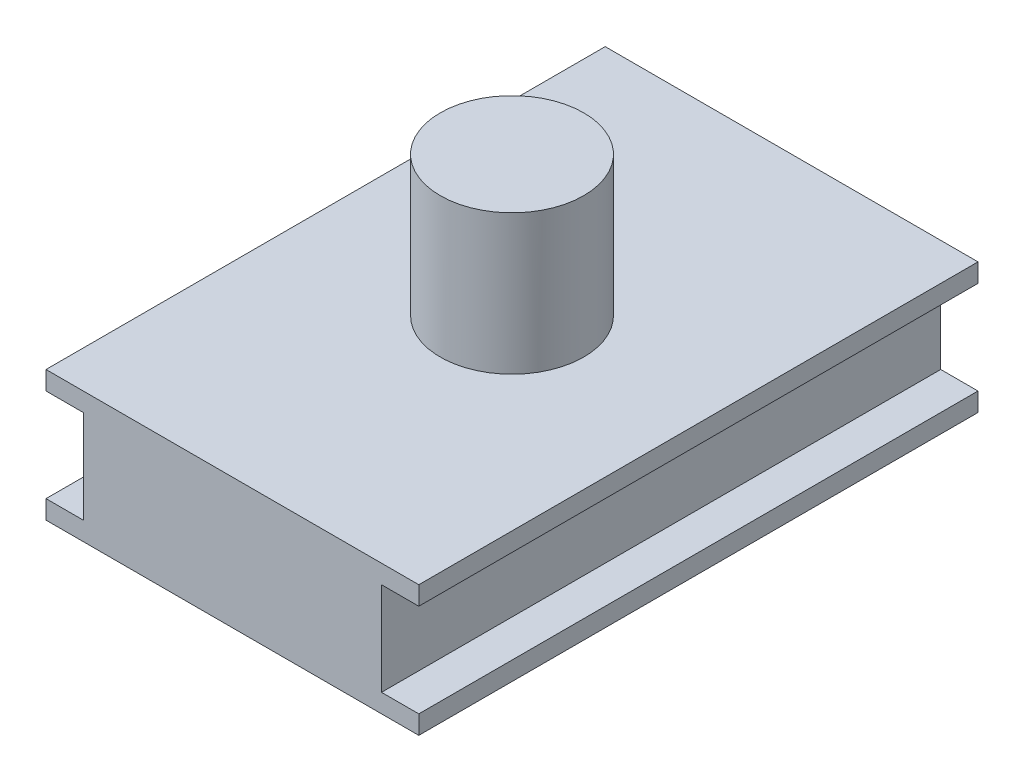
ISO-10303-21;
HEADER;
FILE_DESCRIPTION(('STEP AP214'),'2;1');
FILE_NAME('part.step','',(''),(''),'','','');
FILE_SCHEMA(('AUTOMOTIVE_DESIGN { 1 0 10303 214 1 1 1 1 }'));
ENDSEC;
DATA;
#1=APPLICATION_CONTEXT('core data for automotive mechanical design processes');
#2=APPLICATION_PROTOCOL_DEFINITION('international standard','automotive_design',2000,#1);
#3=PRODUCT_CONTEXT('',#1,'mechanical');
#4=PRODUCT('Part','Part','',(#3));
#5=PRODUCT_RELATED_PRODUCT_CATEGORY('part','',(#4));
#6=PRODUCT_DEFINITION_FORMATION('','',#4);
#7=PRODUCT_DEFINITION_CONTEXT('part definition',#1,'design');
#8=PRODUCT_DEFINITION('design','',#6,#7);
#9=PRODUCT_DEFINITION_SHAPE('','',#8);
#10=(LENGTH_UNIT() NAMED_UNIT(*) SI_UNIT(.MILLI.,.METRE.));
#11=(NAMED_UNIT(*) PLANE_ANGLE_UNIT() SI_UNIT($,.RADIAN.));
#12=(NAMED_UNIT(*) SI_UNIT($,.STERADIAN.) SOLID_ANGLE_UNIT());
#13=UNCERTAINTY_MEASURE_WITH_UNIT(LENGTH_MEASURE(1.E-05),#10,'distance_accuracy_value','');
#14=(GEOMETRIC_REPRESENTATION_CONTEXT(3) GLOBAL_UNCERTAINTY_ASSIGNED_CONTEXT((#13)) GLOBAL_UNIT_ASSIGNED_CONTEXT((#10,
#11,#12)) REPRESENTATION_CONTEXT('',''));
#15=CARTESIAN_POINT('',(0.,0.,0.));
#16=DIRECTION('',(0.,0.,1.));
#17=DIRECTION('',(1.,0.,0.));
#18=AXIS2_PLACEMENT_3D('',#15,#16,#17);
#19=CARTESIAN_POINT('',(0.,7.,0.));
#20=DIRECTION('',(0.,-1.,0.));
#21=DIRECTION('',(0.,0.,-1.));
#22=AXIS2_PLACEMENT_3D('',#19,#20,#21);
#23=PLANE('',#22);
#24=DIRECTION('',(0.,0.,-1.));
#25=VECTOR('',#24,1.);
#26=CARTESIAN_POINT('',(10.,7.,15.));
#27=LINE('',#26,#25);
#28=CARTESIAN_POINT('',(10.,7.,15.));
#29=VERTEX_POINT('',#28);
#30=CARTESIAN_POINT('',(10.,7.,-15.));
#31=VERTEX_POINT('',#30);
#32=EDGE_CURVE('E174',#29,#31,#27,.T.);
#33=ORIENTED_EDGE('',*,*,#32,.T.);
#34=DIRECTION('',(-1.,0.,0.));
#35=VECTOR('',#34,1.);
#36=CARTESIAN_POINT('',(-10.,7.,-15.));
#37=LINE('',#36,#35);
#38=CARTESIAN_POINT('',(-10.,7.,-15.));
#39=VERTEX_POINT('',#38);
#40=EDGE_CURVE('E177',#31,#39,#37,.T.);
#41=ORIENTED_EDGE('',*,*,#40,.T.);
#42=DIRECTION('',(0.,0.,1.));
#43=VECTOR('',#42,1.);
#44=CARTESIAN_POINT('',(-10.,7.,15.));
#45=LINE('',#44,#43);
#46=CARTESIAN_POINT('',(-10.,7.,15.));
#47=VERTEX_POINT('',#46);
#48=EDGE_CURVE('E180',#39,#47,#45,.T.);
#49=ORIENTED_EDGE('',*,*,#48,.T.);
#50=DIRECTION('',(1.,0.,0.));
#51=VECTOR('',#50,1.);
#52=CARTESIAN_POINT('',(-10.,7.,15.));
#53=LINE('',#52,#51);
#54=EDGE_CURVE('E182',#47,#29,#53,.T.);
#55=ORIENTED_EDGE('',*,*,#54,.T.);
#56=EDGE_LOOP('',(#33,#41,#49,#55));
#57=FACE_BOUND('',#56,.T.);
#58=CARTESIAN_POINT('',(0.,7.,0.));
#59=DIRECTION('',(0.,-1.,0.));
#60=DIRECTION('',(0.,0.,-1.));
#61=AXIS2_PLACEMENT_3D('',#58,#59,#60);
#62=CIRCLE('',#61,3.85);
#63=CARTESIAN_POINT('',(0.,7.,-3.85));
#64=VERTEX_POINT('',#63);
#65=EDGE_CURVE('E11',#64,#64,#62,.F.);
#66=ORIENTED_EDGE('',*,*,#65,.F.);
#67=EDGE_LOOP('',(#66));
#68=FACE_BOUND('',#67,.T.);
#69=ADVANCED_FACE('F33',(#57,#68),#23,.F.);
#70=CARTESIAN_POINT('',(-10.,7.,15.));
#71=DIRECTION('',(1.,0.,0.));
#72=DIRECTION('',(0.,0.,-1.));
#73=AXIS2_PLACEMENT_3D('',#70,#71,#72);
#74=PLANE('',#73);
#75=DIRECTION('',(0.,-1.,0.));
#76=VECTOR('',#75,1.);
#77=CARTESIAN_POINT('',(-10.,7.,15.));
#78=LINE('',#77,#76);
#79=CARTESIAN_POINT('',(-10.,1.,15.));
#80=VERTEX_POINT('',#79);
#81=CARTESIAN_POINT('',(-10.,0.,15.));
#82=VERTEX_POINT('',#81);
#83=EDGE_CURVE('E198',#80,#82,#78,.T.);
#84=ORIENTED_EDGE('',*,*,#83,.F.);
#85=DIRECTION('',(0.,0.,1.));
#86=VECTOR('',#85,1.);
#87=CARTESIAN_POINT('',(-10.,1.,-15.));
#88=LINE('',#87,#86);
#89=CARTESIAN_POINT('',(-10.,1.,-15.));
#90=VERTEX_POINT('',#89);
#91=EDGE_CURVE('E137',#90,#80,#88,.T.);
#92=ORIENTED_EDGE('',*,*,#91,.F.);
#93=DIRECTION('',(0.,-1.,0.));
#94=VECTOR('',#93,1.);
#95=CARTESIAN_POINT('',(-10.,7.,-15.));
#96=LINE('',#95,#94);
#97=CARTESIAN_POINT('',(-10.,0.,-15.));
#98=VERTEX_POINT('',#97);
#99=EDGE_CURVE('E200',#90,#98,#96,.T.);
#100=ORIENTED_EDGE('',*,*,#99,.T.);
#101=DIRECTION('',(0.,0.,1.));
#102=VECTOR('',#101,1.);
#103=CARTESIAN_POINT('',(-10.,0.,15.));
#104=LINE('',#103,#102);
#105=EDGE_CURVE('E190',#98,#82,#104,.T.);
#106=ORIENTED_EDGE('',*,*,#105,.T.);
#107=EDGE_LOOP('',(#84,#92,#100,#106));
#108=FACE_BOUND('',#107,.T.);
#109=ADVANCED_FACE('F226',(#108),#74,.F.);
#110=CARTESIAN_POINT('',(10.,7.,15.));
#111=DIRECTION('',(-1.,0.,0.));
#112=DIRECTION('',(0.,0.,1.));
#113=AXIS2_PLACEMENT_3D('',#110,#111,#112);
#114=PLANE('',#113);
#115=DIRECTION('',(0.,-1.,0.));
#116=VECTOR('',#115,1.);
#117=CARTESIAN_POINT('',(10.,7.,-15.));
#118=LINE('',#117,#116);
#119=CARTESIAN_POINT('',(10.,1.,-15.));
#120=VERTEX_POINT('',#119);
#121=CARTESIAN_POINT('',(10.,0.,-15.));
#122=VERTEX_POINT('',#121);
#123=EDGE_CURVE('E203',#120,#122,#118,.T.);
#124=ORIENTED_EDGE('',*,*,#123,.F.);
#125=DIRECTION('',(0.,0.,-1.));
#126=VECTOR('',#125,1.);
#127=CARTESIAN_POINT('',(10.,1.,15.));
#128=LINE('',#127,#126);
#129=CARTESIAN_POINT('',(10.,1.,15.));
#130=VERTEX_POINT('',#129);
#131=EDGE_CURVE('E152',#130,#120,#128,.T.);
#132=ORIENTED_EDGE('',*,*,#131,.F.);
#133=DIRECTION('',(0.,-1.,0.));
#134=VECTOR('',#133,1.);
#135=CARTESIAN_POINT('',(10.,7.,15.));
#136=LINE('',#135,#134);
#137=CARTESIAN_POINT('',(10.,0.,15.));
#138=VERTEX_POINT('',#137);
#139=EDGE_CURVE('E184',#130,#138,#136,.T.);
#140=ORIENTED_EDGE('',*,*,#139,.T.);
#141=DIRECTION('',(0.,0.,-1.));
#142=VECTOR('',#141,1.);
#143=CARTESIAN_POINT('',(10.,0.,15.));
#144=LINE('',#143,#142);
#145=EDGE_CURVE('E167',#138,#122,#144,.T.);
#146=ORIENTED_EDGE('',*,*,#145,.T.);
#147=EDGE_LOOP('',(#124,#132,#140,#146));
#148=FACE_BOUND('',#147,.T.);
#149=ADVANCED_FACE('F220',(#148),#114,.F.);
#150=CARTESIAN_POINT('',(10.,6.,15.));
#151=VERTEX_POINT('',#150);
#152=EDGE_CURVE('E195',#29,#151,#136,.T.);
#153=ORIENTED_EDGE('',*,*,#152,.T.);
#154=DIRECTION('',(0.,0.,1.));
#155=VECTOR('',#154,1.);
#156=CARTESIAN_POINT('',(10.,6.,15.));
#157=LINE('',#156,#155);
#158=CARTESIAN_POINT('',(10.,6.,-15.));
#159=VERTEX_POINT('',#158);
#160=EDGE_CURVE('E160',#159,#151,#157,.T.);
#161=ORIENTED_EDGE('',*,*,#160,.F.);
#162=EDGE_CURVE('E41',#31,#159,#118,.T.);
#163=ORIENTED_EDGE('',*,*,#162,.F.);
#164=ORIENTED_EDGE('',*,*,#32,.F.);
#165=EDGE_LOOP('',(#153,#161,#163,#164));
#166=FACE_BOUND('',#165,.T.);
#167=ADVANCED_FACE('F35',(#166),#114,.F.);
#168=CARTESIAN_POINT('',(-10.,7.,-15.));
#169=DIRECTION('',(0.,0.,1.));
#170=DIRECTION('',(1.,0.,0.));
#171=AXIS2_PLACEMENT_3D('',#168,#169,#170);
#172=PLANE('',#171);
#173=ORIENTED_EDGE('',*,*,#99,.F.);
#174=DIRECTION('',(-1.,0.,0.));
#175=VECTOR('',#174,1.);
#176=CARTESIAN_POINT('',(-8.,1.,-15.));
#177=LINE('',#176,#175);
#178=CARTESIAN_POINT('',(-8.,1.,-15.));
#179=VERTEX_POINT('',#178);
#180=EDGE_CURVE('E145',#179,#90,#177,.T.);
#181=ORIENTED_EDGE('',*,*,#180,.F.);
#182=DIRECTION('',(0.,-1.,0.));
#183=VECTOR('',#182,1.);
#184=CARTESIAN_POINT('',(-8.,1.,-15.));
#185=LINE('',#184,#183);
#186=CARTESIAN_POINT('',(-8.,6.,-15.));
#187=VERTEX_POINT('',#186);
#188=EDGE_CURVE('E130',#187,#179,#185,.T.);
#189=ORIENTED_EDGE('',*,*,#188,.F.);
#190=DIRECTION('',(-1.,0.,0.));
#191=VECTOR('',#190,1.);
#192=CARTESIAN_POINT('',(-8.,6.,-15.));
#193=LINE('',#192,#191);
#194=CARTESIAN_POINT('',(-10.,6.,-15.));
#195=VERTEX_POINT('',#194);
#196=EDGE_CURVE('E128',#187,#195,#193,.T.);
#197=ORIENTED_EDGE('',*,*,#196,.T.);
#198=EDGE_CURVE('E201',#39,#195,#96,.T.);
#199=ORIENTED_EDGE('',*,*,#198,.F.);
#200=ORIENTED_EDGE('',*,*,#40,.F.);
#201=ORIENTED_EDGE('',*,*,#162,.T.);
#202=DIRECTION('',(1.,0.,0.));
#203=VECTOR('',#202,1.);
#204=CARTESIAN_POINT('',(8.,6.,-15.));
#205=LINE('',#204,#203);
#206=CARTESIAN_POINT('',(8.,6.,-15.));
#207=VERTEX_POINT('',#206);
#208=EDGE_CURVE('E159',#207,#159,#205,.T.);
#209=ORIENTED_EDGE('',*,*,#208,.F.);
#210=DIRECTION('',(0.,1.,0.));
#211=VECTOR('',#210,1.);
#212=CARTESIAN_POINT('',(8.,1.,-15.));
#213=LINE('',#212,#211);
#214=CARTESIAN_POINT('',(8.,1.,-15.));
#215=VERTEX_POINT('',#214);
#216=EDGE_CURVE('E150',#215,#207,#213,.T.);
#217=ORIENTED_EDGE('',*,*,#216,.F.);
#218=DIRECTION('',(1.,0.,0.));
#219=VECTOR('',#218,1.);
#220=CARTESIAN_POINT('',(8.,1.,-15.));
#221=LINE('',#220,#219);
#222=EDGE_CURVE('E164',#215,#120,#221,.T.);
#223=ORIENTED_EDGE('',*,*,#222,.T.);
#224=ORIENTED_EDGE('',*,*,#123,.T.);
#225=DIRECTION('',(-1.,0.,0.));
#226=VECTOR('',#225,1.);
#227=CARTESIAN_POINT('',(-10.,0.,-15.));
#228=LINE('',#227,#226);
#229=EDGE_CURVE('E187',#122,#98,#228,.T.);
#230=ORIENTED_EDGE('',*,*,#229,.T.);
#231=EDGE_LOOP('',(#173,#181,#189,#197,#199,#200,#201,#209,#217,#223,#224,#230));
#232=FACE_BOUND('',#231,.T.);
#233=ADVANCED_FACE('F211',(#232),#172,.F.);
#234=ORIENTED_EDGE('',*,*,#198,.T.);
#235=DIRECTION('',(0.,0.,-1.));
#236=VECTOR('',#235,1.);
#237=CARTESIAN_POINT('',(-10.,6.,-15.));
#238=LINE('',#237,#236);
#239=CARTESIAN_POINT('',(-10.,6.,15.));
#240=VERTEX_POINT('',#239);
#241=EDGE_CURVE('E232',#240,#195,#238,.T.);
#242=ORIENTED_EDGE('',*,*,#241,.F.);
#243=EDGE_CURVE('E143',#47,#240,#78,.T.);
#244=ORIENTED_EDGE('',*,*,#243,.F.);
#245=ORIENTED_EDGE('',*,*,#48,.F.);
#246=EDGE_LOOP('',(#234,#242,#244,#245));
#247=FACE_BOUND('',#246,.T.);
#248=ADVANCED_FACE('F256',(#247),#74,.F.);
#249=CARTESIAN_POINT('',(-10.,7.,15.));
#250=DIRECTION('',(0.,0.,-1.));
#251=DIRECTION('',(-1.,0.,0.));
#252=AXIS2_PLACEMENT_3D('',#249,#250,#251);
#253=PLANE('',#252);
#254=DIRECTION('',(0.,1.,0.));
#255=VECTOR('',#254,1.);
#256=CARTESIAN_POINT('',(-8.,1.,15.));
#257=LINE('',#256,#255);
#258=CARTESIAN_POINT('',(-8.,1.,15.));
#259=VERTEX_POINT('',#258);
#260=CARTESIAN_POINT('',(-8.,6.,15.));
#261=VERTEX_POINT('',#260);
#262=EDGE_CURVE('E131',#259,#261,#257,.T.);
#263=ORIENTED_EDGE('',*,*,#262,.F.);
#264=DIRECTION('',(-1.,0.,0.));
#265=VECTOR('',#264,1.);
#266=CARTESIAN_POINT('',(-8.,1.,15.));
#267=LINE('',#266,#265);
#268=EDGE_CURVE('E162',#259,#80,#267,.T.);
#269=ORIENTED_EDGE('',*,*,#268,.T.);
#270=ORIENTED_EDGE('',*,*,#83,.T.);
#271=DIRECTION('',(1.,0.,0.));
#272=VECTOR('',#271,1.);
#273=CARTESIAN_POINT('',(-10.,0.,15.));
#274=LINE('',#273,#272);
#275=EDGE_CURVE('E178',#82,#138,#274,.T.);
#276=ORIENTED_EDGE('',*,*,#275,.T.);
#277=ORIENTED_EDGE('',*,*,#139,.F.);
#278=DIRECTION('',(1.,0.,0.));
#279=VECTOR('',#278,1.);
#280=CARTESIAN_POINT('',(8.,1.,15.));
#281=LINE('',#280,#279);
#282=CARTESIAN_POINT('',(8.,1.,15.));
#283=VERTEX_POINT('',#282);
#284=EDGE_CURVE('E168',#283,#130,#281,.T.);
#285=ORIENTED_EDGE('',*,*,#284,.F.);
#286=DIRECTION('',(0.,-1.,0.));
#287=VECTOR('',#286,1.);
#288=CARTESIAN_POINT('',(8.,1.,15.));
#289=LINE('',#288,#287);
#290=CARTESIAN_POINT('',(8.,6.,15.));
#291=VERTEX_POINT('',#290);
#292=EDGE_CURVE('E154',#291,#283,#289,.T.);
#293=ORIENTED_EDGE('',*,*,#292,.F.);
#294=DIRECTION('',(1.,0.,0.));
#295=VECTOR('',#294,1.);
#296=CARTESIAN_POINT('',(8.,6.,15.));
#297=LINE('',#296,#295);
#298=EDGE_CURVE('E170',#291,#151,#297,.T.);
#299=ORIENTED_EDGE('',*,*,#298,.T.);
#300=ORIENTED_EDGE('',*,*,#152,.F.);
#301=ORIENTED_EDGE('',*,*,#54,.F.);
#302=ORIENTED_EDGE('',*,*,#243,.T.);
#303=DIRECTION('',(-1.,0.,0.));
#304=VECTOR('',#303,1.);
#305=CARTESIAN_POINT('',(-8.,6.,15.));
#306=LINE('',#305,#304);
#307=EDGE_CURVE('E125',#261,#240,#306,.T.);
#308=ORIENTED_EDGE('',*,*,#307,.F.);
#309=EDGE_LOOP('',(#263,#269,#270,#276,#277,#285,#293,#299,#300,#301,#302,#308));
#310=FACE_BOUND('',#309,.T.);
#311=ADVANCED_FACE('F140',(#310),#253,.F.);
#312=CARTESIAN_POINT('',(0.,0.,0.));
#313=DIRECTION('',(0.,-1.,0.));
#314=DIRECTION('',(0.,0.,-1.));
#315=AXIS2_PLACEMENT_3D('',#312,#313,#314);
#316=PLANE('',#315);
#317=ORIENTED_EDGE('',*,*,#145,.F.);
#318=ORIENTED_EDGE('',*,*,#275,.F.);
#319=ORIENTED_EDGE('',*,*,#105,.F.);
#320=ORIENTED_EDGE('',*,*,#229,.F.);
#321=EDGE_LOOP('',(#317,#318,#319,#320));
#322=FACE_BOUND('',#321,.T.);
#323=ADVANCED_FACE('F218',(#322),#316,.T.);
#324=CARTESIAN_POINT('',(8.,1.,15.));
#325=DIRECTION('',(0.,-1.,0.));
#326=DIRECTION('',(0.,0.,-1.));
#327=AXIS2_PLACEMENT_3D('',#324,#325,#326);
#328=PLANE('',#327);
#329=ORIENTED_EDGE('',*,*,#131,.T.);
#330=ORIENTED_EDGE('',*,*,#222,.F.);
#331=DIRECTION('',(0.,0.,-1.));
#332=VECTOR('',#331,1.);
#333=CARTESIAN_POINT('',(8.,1.,15.));
#334=LINE('',#333,#332);
#335=EDGE_CURVE('E156',#283,#215,#334,.T.);
#336=ORIENTED_EDGE('',*,*,#335,.F.);
#337=ORIENTED_EDGE('',*,*,#284,.T.);
#338=EDGE_LOOP('',(#329,#330,#336,#337));
#339=FACE_BOUND('',#338,.T.);
#340=ADVANCED_FACE('F263',(#339),#328,.F.);
#341=CARTESIAN_POINT('',(8.,6.,15.));
#342=DIRECTION('',(0.,1.,0.));
#343=DIRECTION('',(0.,0.,1.));
#344=AXIS2_PLACEMENT_3D('',#341,#342,#343);
#345=PLANE('',#344);
#346=ORIENTED_EDGE('',*,*,#160,.T.);
#347=ORIENTED_EDGE('',*,*,#298,.F.);
#348=DIRECTION('',(0.,0.,1.));
#349=VECTOR('',#348,1.);
#350=CARTESIAN_POINT('',(8.,6.,15.));
#351=LINE('',#350,#349);
#352=EDGE_CURVE('E56',#207,#291,#351,.T.);
#353=ORIENTED_EDGE('',*,*,#352,.F.);
#354=ORIENTED_EDGE('',*,*,#208,.T.);
#355=EDGE_LOOP('',(#346,#347,#353,#354));
#356=FACE_BOUND('',#355,.T.);
#357=ADVANCED_FACE('F259',(#356),#345,.F.);
#358=CARTESIAN_POINT('',(8.,0.,0.));
#359=DIRECTION('',(-1.,0.,0.));
#360=DIRECTION('',(0.,0.,1.));
#361=AXIS2_PLACEMENT_3D('',#358,#359,#360);
#362=PLANE('',#361);
#363=ORIENTED_EDGE('',*,*,#216,.T.);
#364=ORIENTED_EDGE('',*,*,#352,.T.);
#365=ORIENTED_EDGE('',*,*,#292,.T.);
#366=ORIENTED_EDGE('',*,*,#335,.T.);
#367=EDGE_LOOP('',(#363,#364,#365,#366));
#368=FACE_BOUND('',#367,.T.);
#369=ADVANCED_FACE('F280',(#368),#362,.F.);
#370=CARTESIAN_POINT('',(-8.,1.,-15.));
#371=DIRECTION('',(0.,-1.,0.));
#372=DIRECTION('',(0.,0.,-1.));
#373=AXIS2_PLACEMENT_3D('',#370,#371,#372);
#374=PLANE('',#373);
#375=ORIENTED_EDGE('',*,*,#91,.T.);
#376=ORIENTED_EDGE('',*,*,#268,.F.);
#377=DIRECTION('',(0.,0.,1.));
#378=VECTOR('',#377,1.);
#379=CARTESIAN_POINT('',(-8.,1.,-15.));
#380=LINE('',#379,#378);
#381=EDGE_CURVE('E48',#179,#259,#380,.T.);
#382=ORIENTED_EDGE('',*,*,#381,.F.);
#383=ORIENTED_EDGE('',*,*,#180,.T.);
#384=EDGE_LOOP('',(#375,#376,#382,#383));
#385=FACE_BOUND('',#384,.T.);
#386=ADVANCED_FACE('F290',(#385),#374,.F.);
#387=CARTESIAN_POINT('',(-8.,6.,-15.));
#388=DIRECTION('',(0.,1.,0.));
#389=DIRECTION('',(0.,0.,1.));
#390=AXIS2_PLACEMENT_3D('',#387,#388,#389);
#391=PLANE('',#390);
#392=ORIENTED_EDGE('',*,*,#241,.T.);
#393=ORIENTED_EDGE('',*,*,#196,.F.);
#394=DIRECTION('',(0.,0.,-1.));
#395=VECTOR('',#394,1.);
#396=CARTESIAN_POINT('',(-8.,6.,-15.));
#397=LINE('',#396,#395);
#398=EDGE_CURVE('E122',#261,#187,#397,.T.);
#399=ORIENTED_EDGE('',*,*,#398,.F.);
#400=ORIENTED_EDGE('',*,*,#307,.T.);
#401=EDGE_LOOP('',(#392,#393,#399,#400));
#402=FACE_BOUND('',#401,.T.);
#403=ADVANCED_FACE('F123',(#402),#391,.F.);
#404=CARTESIAN_POINT('',(-8.,0.,0.));
#405=DIRECTION('',(1.,0.,0.));
#406=DIRECTION('',(0.,0.,-1.));
#407=AXIS2_PLACEMENT_3D('',#404,#405,#406);
#408=PLANE('',#407);
#409=ORIENTED_EDGE('',*,*,#262,.T.);
#410=ORIENTED_EDGE('',*,*,#398,.T.);
#411=ORIENTED_EDGE('',*,*,#188,.T.);
#412=ORIENTED_EDGE('',*,*,#381,.T.);
#413=EDGE_LOOP('',(#409,#410,#411,#412));
#414=FACE_BOUND('',#413,.T.);
#415=ADVANCED_FACE('F134',(#414),#408,.F.);
#416=CARTESIAN_POINT('',(0.,14.5,0.));
#417=DIRECTION('',(0.,-1.,0.));
#418=DIRECTION('',(0.,0.,-1.));
#419=AXIS2_PLACEMENT_3D('',#416,#417,#418);
#420=CYLINDRICAL_SURFACE('',#419,3.85);
#421=CARTESIAN_POINT('',(0.,14.5,0.));
#422=DIRECTION('',(0.,1.,0.));
#423=DIRECTION('',(0.,0.,1.));
#424=AXIS2_PLACEMENT_3D('',#421,#422,#423);
#425=CIRCLE('',#424,3.85);
#426=CARTESIAN_POINT('',(0.,14.5,3.85));
#427=VERTEX_POINT('',#426);
#428=EDGE_CURVE('E233',#427,#427,#425,.T.);
#429=ORIENTED_EDGE('',*,*,#428,.F.);
#430=EDGE_LOOP('',(#429));
#431=FACE_BOUND('',#430,.T.);
#432=ORIENTED_EDGE('',*,*,#65,.T.);
#433=EDGE_LOOP('',(#432));
#434=FACE_BOUND('',#433,.T.);
#435=ADVANCED_FACE('F241',(#431,#434),#420,.T.);
#436=CARTESIAN_POINT('',(0.,14.5,0.));
#437=DIRECTION('',(0.,1.,0.));
#438=DIRECTION('',(0.,0.,1.));
#439=AXIS2_PLACEMENT_3D('',#436,#437,#438);
#440=PLANE('',#439);
#441=ORIENTED_EDGE('',*,*,#428,.T.);
#442=EDGE_LOOP('',(#441));
#443=FACE_BOUND('',#442,.T.);
#444=ADVANCED_FACE('F239',(#443),#440,.T.);
#445=CLOSED_SHELL('',(#69,#109,#149,#167,#233,#248,#311,#323,#340,#357,#369,#386,#403,#415,#435,#444));
#446=MANIFOLD_SOLID_BREP('B2',#445);
#447=ADVANCED_BREP_SHAPE_REPRESENTATION('',(#18,#446),#14);
#448=SHAPE_DEFINITION_REPRESENTATION(#9,#447);
ENDSEC;
END-ISO-10303-21;
